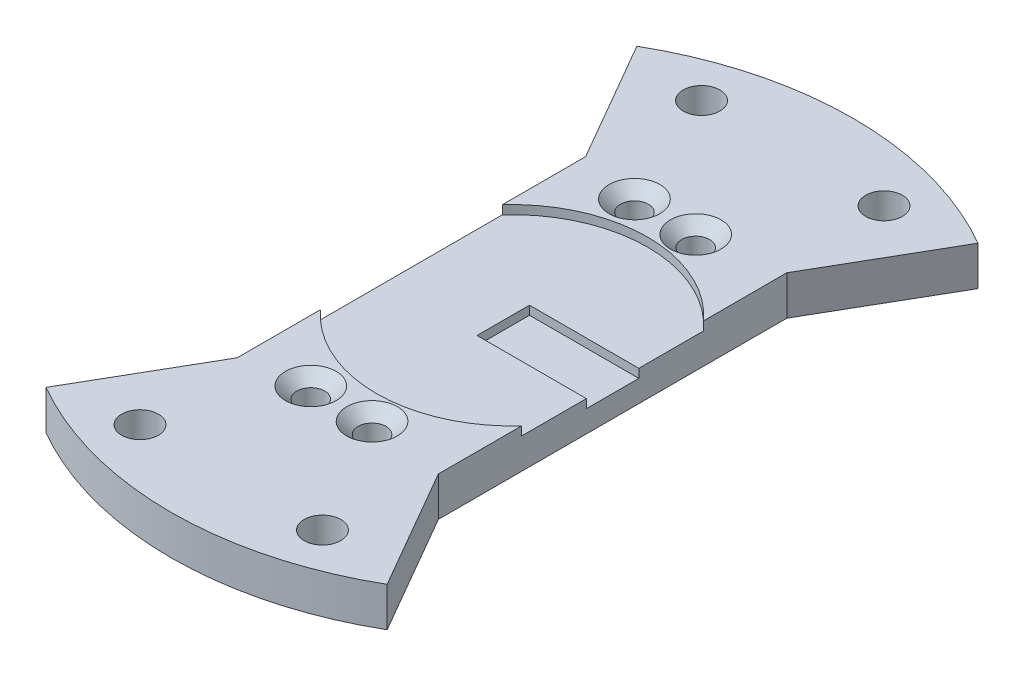
ISO-10303-21;
HEADER;
FILE_DESCRIPTION(('STEP AP214'),'2;1');
FILE_NAME('part.step','',(''),(''),'','','');
FILE_SCHEMA(('AUTOMOTIVE_DESIGN { 1 0 10303 214 1 1 1 1 }'));
ENDSEC;
DATA;
#1=APPLICATION_CONTEXT('core data for automotive mechanical design processes');
#2=APPLICATION_PROTOCOL_DEFINITION('international standard','automotive_design',2000,#1);
#3=PRODUCT_CONTEXT('',#1,'mechanical');
#4=PRODUCT('Part','Part','',(#3));
#5=PRODUCT_RELATED_PRODUCT_CATEGORY('part','',(#4));
#6=PRODUCT_DEFINITION_FORMATION('','',#4);
#7=PRODUCT_DEFINITION_CONTEXT('part definition',#1,'design');
#8=PRODUCT_DEFINITION('design','',#6,#7);
#9=PRODUCT_DEFINITION_SHAPE('','',#8);
#10=(LENGTH_UNIT() NAMED_UNIT(*) SI_UNIT(.MILLI.,.METRE.));
#11=(NAMED_UNIT(*) PLANE_ANGLE_UNIT() SI_UNIT($,.RADIAN.));
#12=(NAMED_UNIT(*) SI_UNIT($,.STERADIAN.) SOLID_ANGLE_UNIT());
#13=UNCERTAINTY_MEASURE_WITH_UNIT(LENGTH_MEASURE(1.E-05),#10,'distance_accuracy_value','');
#14=(GEOMETRIC_REPRESENTATION_CONTEXT(3) GLOBAL_UNCERTAINTY_ASSIGNED_CONTEXT((#13)) GLOBAL_UNIT_ASSIGNED_CONTEXT((#10,
#11,#12)) REPRESENTATION_CONTEXT('',''));
#15=CARTESIAN_POINT('',(0.,0.,0.));
#16=DIRECTION('',(0.,0.,1.));
#17=DIRECTION('',(1.,0.,0.));
#18=AXIS2_PLACEMENT_3D('',#15,#16,#17);
#19=CARTESIAN_POINT('',(0.,4.5,0.));
#20=DIRECTION('',(0.,1.,0.));
#21=DIRECTION('',(0.,0.,1.));
#22=AXIS2_PLACEMENT_3D('',#19,#20,#21);
#23=PLANE('',#22);
#24=CARTESIAN_POINT('',(-4.5,4.5,-18.5));
#25=DIRECTION('',(0.,1.,0.));
#26=DIRECTION('',(0.,0.,1.));
#27=AXIS2_PLACEMENT_3D('',#24,#25,#26);
#28=CIRCLE('',#27,2.9);
#29=CARTESIAN_POINT('',(-4.5,4.5,-15.6));
#30=VERTEX_POINT('',#29);
#31=EDGE_CURVE('E368',#30,#30,#28,.T.);
#32=ORIENTED_EDGE('',*,*,#31,.F.);
#33=EDGE_LOOP('',(#32));
#34=FACE_BOUND('',#33,.T.);
#35=CARTESIAN_POINT('',(2.5,4.5,-18.5));
#36=DIRECTION('',(0.,1.,0.));
#37=DIRECTION('',(0.,0.,1.));
#38=AXIS2_PLACEMENT_3D('',#35,#36,#37);
#39=CIRCLE('',#38,2.9);
#40=CARTESIAN_POINT('',(2.5,4.5,-15.6));
#41=VERTEX_POINT('',#40);
#42=EDGE_CURVE('E379',#41,#41,#39,.T.);
#43=ORIENTED_EDGE('',*,*,#42,.F.);
#44=EDGE_LOOP('',(#43));
#45=FACE_BOUND('',#44,.T.);
#46=CARTESIAN_POINT('',(0.,4.5,0.));
#47=DIRECTION('',(0.,1.,0.));
#48=DIRECTION('',(0.,0.,1.));
#49=AXIS2_PLACEMENT_3D('',#46,#47,#48);
#50=CIRCLE('',#49,15.5);
#51=CARTESIAN_POINT('',(11.5,4.5,-10.3923048454133));
#52=VERTEX_POINT('',#51);
#53=CARTESIAN_POINT('',(-11.5,4.5,-10.3923048454133));
#54=VERTEX_POINT('',#53);
#55=EDGE_CURVE('E274',#52,#54,#50,.T.);
#56=ORIENTED_EDGE('',*,*,#55,.F.);
#57=DIRECTION('',(0.,0.,1.));
#58=VECTOR('',#57,1.);
#59=CARTESIAN_POINT('',(11.5,4.5,0.));
#60=LINE('',#59,#58);
#61=CARTESIAN_POINT('',(11.5,4.5,-19.9185842870421));
#62=VERTEX_POINT('',#61);
#63=EDGE_CURVE('E205',#62,#52,#60,.T.);
#64=ORIENTED_EDGE('',*,*,#63,.F.);
#65=DIRECTION('',(0.5,0.,-0.866025403784439));
#66=VECTOR('',#65,1.);
#67=CARTESIAN_POINT('',(0.,4.5,0.));
#68=LINE('',#67,#66);
#69=CARTESIAN_POINT('',(19.5,4.5,-33.7749907475931));
#70=VERTEX_POINT('',#69);
#71=EDGE_CURVE('E208',#62,#70,#68,.T.);
#72=ORIENTED_EDGE('',*,*,#71,.T.);
#73=CARTESIAN_POINT('',(0.,4.5,0.));
#74=DIRECTION('',(0.,1.,0.));
#75=DIRECTION('',(0.,0.,1.));
#76=AXIS2_PLACEMENT_3D('',#73,#74,#75);
#77=CIRCLE('',#76,39.);
#78=CARTESIAN_POINT('',(-19.5,4.5,-33.7749907475931));
#79=VERTEX_POINT('',#78);
#80=EDGE_CURVE('E210',#70,#79,#77,.T.);
#81=ORIENTED_EDGE('',*,*,#80,.T.);
#82=DIRECTION('',(-0.5,0.,-0.866025403784439));
#83=VECTOR('',#82,1.);
#84=CARTESIAN_POINT('',(0.,4.5,0.));
#85=LINE('',#84,#83);
#86=CARTESIAN_POINT('',(-11.5,4.5,-19.9185842870421));
#87=VERTEX_POINT('',#86);
#88=EDGE_CURVE('E189',#87,#79,#85,.T.);
#89=ORIENTED_EDGE('',*,*,#88,.F.);
#90=DIRECTION('',(0.,0.,1.));
#91=VECTOR('',#90,1.);
#92=CARTESIAN_POINT('',(-11.5,4.5,0.));
#93=LINE('',#92,#91);
#94=EDGE_CURVE('E194',#87,#54,#93,.T.);
#95=ORIENTED_EDGE('',*,*,#94,.T.);
#96=EDGE_LOOP('',(#56,#64,#72,#81,#89,#95));
#97=FACE_BOUND('',#96,.T.);
#98=CARTESIAN_POINT('',(-10.4293235601544,4.5,-32.0981574249615));
#99=DIRECTION('',(0.,1.,0.));
#100=DIRECTION('',(0.,0.,1.));
#101=AXIS2_PLACEMENT_3D('',#98,#99,#100);
#102=CIRCLE('',#101,2.1);
#103=CARTESIAN_POINT('',(-10.4293235601544,4.5,-29.9981574249615));
#104=VERTEX_POINT('',#103);
#105=EDGE_CURVE('E221',#104,#104,#102,.T.);
#106=ORIENTED_EDGE('',*,*,#105,.F.);
#107=EDGE_LOOP('',(#106));
#108=FACE_BOUND('',#107,.T.);
#109=CARTESIAN_POINT('',(10.4293235601546,4.5,-32.0981574249614));
#110=DIRECTION('',(0.,1.,0.));
#111=DIRECTION('',(0.,0.,1.));
#112=AXIS2_PLACEMENT_3D('',#109,#110,#111);
#113=CIRCLE('',#112,2.1);
#114=CARTESIAN_POINT('',(10.4293235601546,4.5,-29.9981574249614));
#115=VERTEX_POINT('',#114);
#116=EDGE_CURVE('E218',#115,#115,#113,.T.);
#117=ORIENTED_EDGE('',*,*,#116,.F.);
#118=EDGE_LOOP('',(#117));
#119=FACE_BOUND('',#118,.T.);
#120=ADVANCED_FACE('F32',(#34,#45,#97,#108,#119),#23,.T.);
#121=CARTESIAN_POINT('',(0.,4.5,0.));
#122=DIRECTION('',(-0.866025403784439,0.,0.5));
#123=DIRECTION('',(0.5,0.,0.866025403784439));
#124=AXIS2_PLACEMENT_3D('',#121,#122,#123);
#125=PLANE('',#124);
#126=DIRECTION('',(-0.5,0.,-0.866025403784439));
#127=VECTOR('',#126,1.);
#128=CARTESIAN_POINT('',(0.,0.,0.));
#129=LINE('',#128,#127);
#130=CARTESIAN_POINT('',(-11.5,0.,-19.9185842870421));
#131=VERTEX_POINT('',#130);
#132=CARTESIAN_POINT('',(-19.5,0.,-33.7749907475931));
#133=VERTEX_POINT('',#132);
#134=EDGE_CURVE('E188',#131,#133,#129,.T.);
#135=ORIENTED_EDGE('',*,*,#134,.F.);
#136=DIRECTION('',(0.,-1.,0.));
#137=VECTOR('',#136,1.);
#138=CARTESIAN_POINT('',(-11.5,4.5,-19.9185842870421));
#139=LINE('',#138,#137);
#140=EDGE_CURVE('E272',#87,#131,#139,.T.);
#141=ORIENTED_EDGE('',*,*,#140,.F.);
#142=ORIENTED_EDGE('',*,*,#88,.T.);
#143=DIRECTION('',(0.,-1.,0.));
#144=VECTOR('',#143,1.);
#145=CARTESIAN_POINT('',(-19.5,4.5,-33.7749907475931));
#146=LINE('',#145,#144);
#147=EDGE_CURVE('E224',#79,#133,#146,.T.);
#148=ORIENTED_EDGE('',*,*,#147,.T.);
#149=EDGE_LOOP('',(#135,#141,#142,#148));
#150=FACE_BOUND('',#149,.T.);
#151=ADVANCED_FACE('F34',(#150),#125,.T.);
#152=CARTESIAN_POINT('',(-11.5,4.5,0.));
#153=DIRECTION('',(1.,0.,0.));
#154=DIRECTION('',(0.,0.,-1.));
#155=AXIS2_PLACEMENT_3D('',#152,#153,#154);
#156=PLANE('',#155);
#157=DIRECTION('',(0.,0.,1.));
#158=VECTOR('',#157,1.);
#159=CARTESIAN_POINT('',(-11.5,3.5,0.));
#160=LINE('',#159,#158);
#161=CARTESIAN_POINT('',(-11.5,3.5,-10.3923048454133));
#162=VERTEX_POINT('',#161);
#163=CARTESIAN_POINT('',(-11.5,3.5,10.3923048454133));
#164=VERTEX_POINT('',#163);
#165=EDGE_CURVE('E186',#162,#164,#160,.T.);
#166=ORIENTED_EDGE('',*,*,#165,.F.);
#167=DIRECTION('',(0.,1.,0.));
#168=VECTOR('',#167,1.);
#169=CARTESIAN_POINT('',(-11.5,3.5,-10.3923048454133));
#170=LINE('',#169,#168);
#171=EDGE_CURVE('E183',#162,#54,#170,.T.);
#172=ORIENTED_EDGE('',*,*,#171,.T.);
#173=ORIENTED_EDGE('',*,*,#94,.F.);
#174=ORIENTED_EDGE('',*,*,#140,.T.);
#175=DIRECTION('',(0.,0.,1.));
#176=VECTOR('',#175,1.);
#177=CARTESIAN_POINT('',(-11.5,0.,0.));
#178=LINE('',#177,#176);
#179=CARTESIAN_POINT('',(-11.5,0.,19.9185842870424));
#180=VERTEX_POINT('',#179);
#181=EDGE_CURVE('E227',#131,#180,#178,.T.);
#182=ORIENTED_EDGE('',*,*,#181,.T.);
#183=DIRECTION('',(0.,-1.,0.));
#184=VECTOR('',#183,1.);
#185=CARTESIAN_POINT('',(-11.5,4.5,19.9185842870424));
#186=LINE('',#185,#184);
#187=CARTESIAN_POINT('',(-11.5,4.5,19.9185842870424));
#188=VERTEX_POINT('',#187);
#189=EDGE_CURVE('E269',#188,#180,#186,.T.);
#190=ORIENTED_EDGE('',*,*,#189,.F.);
#191=CARTESIAN_POINT('',(-11.5,4.5,10.3923048454133));
#192=VERTEX_POINT('',#191);
#193=EDGE_CURVE('E192',#192,#188,#93,.T.);
#194=ORIENTED_EDGE('',*,*,#193,.F.);
#195=DIRECTION('',(0.,1.,0.));
#196=VECTOR('',#195,1.);
#197=CARTESIAN_POINT('',(-11.5,3.5,10.3923048454133));
#198=LINE('',#197,#196);
#199=EDGE_CURVE('E55',#192,#164,#198,.F.);
#200=ORIENTED_EDGE('',*,*,#199,.T.);
#201=EDGE_LOOP('',(#166,#172,#173,#174,#182,#190,#194,#200));
#202=FACE_BOUND('',#201,.T.);
#203=ADVANCED_FACE('F288',(#202),#156,.F.);
#204=CARTESIAN_POINT('',(0.,4.5,0.));
#205=DIRECTION('',(0.866025403784442,0.,0.499999999999995));
#206=DIRECTION('',(0.499999999999995,0.,-0.866025403784442));
#207=AXIS2_PLACEMENT_3D('',#204,#205,#206);
#208=PLANE('',#207);
#209=DIRECTION('',(-0.499999999999995,0.,0.866025403784442));
#210=VECTOR('',#209,1.);
#211=CARTESIAN_POINT('',(0.,0.,0.));
#212=LINE('',#211,#210);
#213=CARTESIAN_POINT('',(-19.4999999999998,0.,33.7749907475932));
#214=VERTEX_POINT('',#213);
#215=EDGE_CURVE('E229',#180,#214,#212,.T.);
#216=ORIENTED_EDGE('',*,*,#215,.T.);
#217=DIRECTION('',(0.,-1.,0.));
#218=VECTOR('',#217,1.);
#219=CARTESIAN_POINT('',(-19.4999999999998,4.5,33.7749907475932));
#220=LINE('',#219,#218);
#221=CARTESIAN_POINT('',(-19.4999999999998,4.5,33.7749907475932));
#222=VERTEX_POINT('',#221);
#223=EDGE_CURVE('E266',#222,#214,#220,.T.);
#224=ORIENTED_EDGE('',*,*,#223,.F.);
#225=DIRECTION('',(-0.499999999999995,0.,0.866025403784442));
#226=VECTOR('',#225,1.);
#227=CARTESIAN_POINT('',(0.,4.5,0.));
#228=LINE('',#227,#226);
#229=EDGE_CURVE('E197',#188,#222,#228,.T.);
#230=ORIENTED_EDGE('',*,*,#229,.F.);
#231=ORIENTED_EDGE('',*,*,#189,.T.);
#232=EDGE_LOOP('',(#216,#224,#230,#231));
#233=FACE_BOUND('',#232,.T.);
#234=ADVANCED_FACE('F618',(#233),#208,.F.);
#235=CARTESIAN_POINT('',(0.,4.5,0.));
#236=DIRECTION('',(0.,-1.,0.));
#237=DIRECTION('',(0.,0.,-1.));
#238=AXIS2_PLACEMENT_3D('',#235,#236,#237);
#239=CYLINDRICAL_SURFACE('',#238,39.);
#240=CARTESIAN_POINT('',(0.,0.,0.));
#241=DIRECTION('',(0.,1.,0.));
#242=DIRECTION('',(0.,0.,1.));
#243=AXIS2_PLACEMENT_3D('',#240,#241,#242);
#244=CIRCLE('',#243,39.);
#245=CARTESIAN_POINT('',(19.4999999999998,0.,33.7749907475932));
#246=VERTEX_POINT('',#245);
#247=EDGE_CURVE('E231',#214,#246,#244,.T.);
#248=ORIENTED_EDGE('',*,*,#247,.T.);
#249=DIRECTION('',(0.,-1.,0.));
#250=VECTOR('',#249,1.);
#251=CARTESIAN_POINT('',(19.4999999999998,4.5,33.7749907475932));
#252=LINE('',#251,#250);
#253=CARTESIAN_POINT('',(19.4999999999998,4.5,33.7749907475932));
#254=VERTEX_POINT('',#253);
#255=EDGE_CURVE('E264',#254,#246,#252,.T.);
#256=ORIENTED_EDGE('',*,*,#255,.F.);
#257=CARTESIAN_POINT('',(0.,4.5,0.));
#258=DIRECTION('',(0.,1.,0.));
#259=DIRECTION('',(0.,0.,1.));
#260=AXIS2_PLACEMENT_3D('',#257,#258,#259);
#261=CIRCLE('',#260,39.);
#262=EDGE_CURVE('E199',#222,#254,#261,.T.);
#263=ORIENTED_EDGE('',*,*,#262,.F.);
#264=ORIENTED_EDGE('',*,*,#223,.T.);
#265=EDGE_LOOP('',(#248,#256,#263,#264));
#266=FACE_BOUND('',#265,.T.);
#267=ADVANCED_FACE('F609',(#266),#239,.T.);
#268=CARTESIAN_POINT('',(0.,4.5,0.));
#269=DIRECTION('',(0.866025403784442,0.,-0.499999999999995));
#270=DIRECTION('',(-0.499999999999995,0.,-0.866025403784442));
#271=AXIS2_PLACEMENT_3D('',#268,#269,#270);
#272=PLANE('',#271);
#273=DIRECTION('',(0.499999999999995,0.,0.866025403784442));
#274=VECTOR('',#273,1.);
#275=CARTESIAN_POINT('',(0.,0.,0.));
#276=LINE('',#275,#274);
#277=CARTESIAN_POINT('',(11.5,0.,19.9185842870424));
#278=VERTEX_POINT('',#277);
#279=EDGE_CURVE('E234',#278,#246,#276,.T.);
#280=ORIENTED_EDGE('',*,*,#279,.F.);
#281=DIRECTION('',(0.,-1.,0.));
#282=VECTOR('',#281,1.);
#283=CARTESIAN_POINT('',(11.5,4.5,19.9185842870424));
#284=LINE('',#283,#282);
#285=CARTESIAN_POINT('',(11.5,4.5,19.9185842870424));
#286=VERTEX_POINT('',#285);
#287=EDGE_CURVE('E262',#286,#278,#284,.T.);
#288=ORIENTED_EDGE('',*,*,#287,.F.);
#289=DIRECTION('',(0.499999999999995,0.,0.866025403784442));
#290=VECTOR('',#289,1.);
#291=CARTESIAN_POINT('',(0.,4.5,0.));
#292=LINE('',#291,#290);
#293=EDGE_CURVE('E201',#286,#254,#292,.T.);
#294=ORIENTED_EDGE('',*,*,#293,.T.);
#295=ORIENTED_EDGE('',*,*,#255,.T.);
#296=EDGE_LOOP('',(#280,#288,#294,#295));
#297=FACE_BOUND('',#296,.T.);
#298=ADVANCED_FACE('F302',(#297),#272,.T.);
#299=CARTESIAN_POINT('',(11.5,4.5,0.));
#300=DIRECTION('',(1.,0.,0.));
#301=DIRECTION('',(0.,0.,-1.));
#302=AXIS2_PLACEMENT_3D('',#299,#300,#301);
#303=PLANE('',#302);
#304=DIRECTION('',(0.,1.,0.));
#305=VECTOR('',#304,1.);
#306=CARTESIAN_POINT('',(11.5,2.5,3.));
#307=LINE('',#306,#305);
#308=CARTESIAN_POINT('',(11.5,2.5,3.));
#309=VERTEX_POINT('',#308);
#310=CARTESIAN_POINT('',(11.5,3.5,3.));
#311=VERTEX_POINT('',#310);
#312=EDGE_CURVE('E176',#309,#311,#307,.T.);
#313=ORIENTED_EDGE('',*,*,#312,.T.);
#314=DIRECTION('',(0.,0.,1.));
#315=VECTOR('',#314,1.);
#316=CARTESIAN_POINT('',(11.5,3.5,0.));
#317=LINE('',#316,#315);
#318=CARTESIAN_POINT('',(11.5,3.5,10.3923048454133));
#319=VERTEX_POINT('',#318);
#320=EDGE_CURVE('E40',#311,#319,#317,.T.);
#321=ORIENTED_EDGE('',*,*,#320,.T.);
#322=DIRECTION('',(0.,1.,0.));
#323=VECTOR('',#322,1.);
#324=CARTESIAN_POINT('',(11.5,3.5,10.3923048454133));
#325=LINE('',#324,#323);
#326=CARTESIAN_POINT('',(11.5,4.5,10.3923048454133));
#327=VERTEX_POINT('',#326);
#328=EDGE_CURVE('E177',#327,#319,#325,.F.);
#329=ORIENTED_EDGE('',*,*,#328,.F.);
#330=EDGE_CURVE('E204',#327,#286,#60,.T.);
#331=ORIENTED_EDGE('',*,*,#330,.T.);
#332=ORIENTED_EDGE('',*,*,#287,.T.);
#333=DIRECTION('',(0.,0.,1.));
#334=VECTOR('',#333,1.);
#335=CARTESIAN_POINT('',(11.5,0.,0.));
#336=LINE('',#335,#334);
#337=CARTESIAN_POINT('',(11.5,0.,-19.9185842870421));
#338=VERTEX_POINT('',#337);
#339=EDGE_CURVE('E237',#338,#278,#336,.T.);
#340=ORIENTED_EDGE('',*,*,#339,.F.);
#341=DIRECTION('',(0.,-1.,0.));
#342=VECTOR('',#341,1.);
#343=CARTESIAN_POINT('',(11.5,4.5,-19.9185842870421));
#344=LINE('',#343,#342);
#345=EDGE_CURVE('E260',#62,#338,#344,.T.);
#346=ORIENTED_EDGE('',*,*,#345,.F.);
#347=ORIENTED_EDGE('',*,*,#63,.T.);
#348=DIRECTION('',(0.,1.,0.));
#349=VECTOR('',#348,1.);
#350=CARTESIAN_POINT('',(11.5,3.5,-10.3923048454133));
#351=LINE('',#350,#349);
#352=CARTESIAN_POINT('',(11.5,3.5,-10.3923048454133));
#353=VERTEX_POINT('',#352);
#354=EDGE_CURVE('E180',#353,#52,#351,.T.);
#355=ORIENTED_EDGE('',*,*,#354,.F.);
#356=CARTESIAN_POINT('',(11.5,3.5,-3.));
#357=VERTEX_POINT('',#356);
#358=EDGE_CURVE('E11',#353,#357,#317,.T.);
#359=ORIENTED_EDGE('',*,*,#358,.T.);
#360=DIRECTION('',(0.,1.,0.));
#361=VECTOR('',#360,1.);
#362=CARTESIAN_POINT('',(11.5,2.5,-3.));
#363=LINE('',#362,#361);
#364=CARTESIAN_POINT('',(11.5,2.5,-3.));
#365=VERTEX_POINT('',#364);
#366=EDGE_CURVE('E47',#365,#357,#363,.T.);
#367=ORIENTED_EDGE('',*,*,#366,.F.);
#368=DIRECTION('',(0.,0.,-1.));
#369=VECTOR('',#368,1.);
#370=CARTESIAN_POINT('',(11.5,2.5,-3.));
#371=LINE('',#370,#369);
#372=EDGE_CURVE('E153',#309,#365,#371,.T.);
#373=ORIENTED_EDGE('',*,*,#372,.F.);
#374=EDGE_LOOP('',(#313,#321,#329,#331,#332,#340,#346,#347,#355,#359,#367,#373));
#375=FACE_BOUND('',#374,.T.);
#376=ADVANCED_FACE('F164',(#375),#303,.T.);
#377=CARTESIAN_POINT('',(0.,4.5,0.));
#378=DIRECTION('',(-0.866025403784439,0.,-0.5));
#379=DIRECTION('',(-0.5,0.,0.866025403784439));
#380=AXIS2_PLACEMENT_3D('',#377,#378,#379);
#381=PLANE('',#380);
#382=DIRECTION('',(0.5,0.,-0.866025403784439));
#383=VECTOR('',#382,1.);
#384=CARTESIAN_POINT('',(0.,0.,0.));
#385=LINE('',#384,#383);
#386=CARTESIAN_POINT('',(19.5,0.,-33.7749907475931));
#387=VERTEX_POINT('',#386);
#388=EDGE_CURVE('E240',#338,#387,#385,.T.);
#389=ORIENTED_EDGE('',*,*,#388,.T.);
#390=DIRECTION('',(0.,-1.,0.));
#391=VECTOR('',#390,1.);
#392=CARTESIAN_POINT('',(19.5,4.5,-33.7749907475931));
#393=LINE('',#392,#391);
#394=EDGE_CURVE('E257',#70,#387,#393,.T.);
#395=ORIENTED_EDGE('',*,*,#394,.F.);
#396=ORIENTED_EDGE('',*,*,#71,.F.);
#397=ORIENTED_EDGE('',*,*,#345,.T.);
#398=EDGE_LOOP('',(#389,#395,#396,#397));
#399=FACE_BOUND('',#398,.T.);
#400=ADVANCED_FACE('F314',(#399),#381,.F.);
#401=CARTESIAN_POINT('',(10.4293235601546,4.5,-32.0981574249614));
#402=DIRECTION('',(0.,-1.,0.));
#403=DIRECTION('',(0.,0.,-1.));
#404=AXIS2_PLACEMENT_3D('',#401,#402,#403);
#405=CYLINDRICAL_SURFACE('',#404,2.1);
#406=ORIENTED_EDGE('',*,*,#116,.T.);
#407=EDGE_LOOP('',(#406));
#408=FACE_BOUND('',#407,.T.);
#409=CARTESIAN_POINT('',(10.4293235601546,0.,-32.0981574249614));
#410=DIRECTION('',(0.,1.,0.));
#411=DIRECTION('',(0.,0.,1.));
#412=AXIS2_PLACEMENT_3D('',#409,#410,#411);
#413=CIRCLE('',#412,2.1);
#414=CARTESIAN_POINT('',(10.4293235601546,0.,-29.9981574249614));
#415=VERTEX_POINT('',#414);
#416=EDGE_CURVE('E251',#415,#415,#413,.T.);
#417=ORIENTED_EDGE('',*,*,#416,.F.);
#418=EDGE_LOOP('',(#417));
#419=FACE_BOUND('',#418,.T.);
#420=ADVANCED_FACE('F590',(#408,#419),#405,.F.);
#421=CARTESIAN_POINT('',(10.4293235601542,4.5,32.0981574249615));
#422=DIRECTION('',(0.,-1.,0.));
#423=DIRECTION('',(0.,0.,-1.));
#424=AXIS2_PLACEMENT_3D('',#421,#422,#423);
#425=CYLINDRICAL_SURFACE('',#424,2.1);
#426=CARTESIAN_POINT('',(10.4293235601542,4.5,32.0981574249615));
#427=DIRECTION('',(0.,1.,0.));
#428=DIRECTION('',(0.,0.,1.));
#429=AXIS2_PLACEMENT_3D('',#426,#427,#428);
#430=CIRCLE('',#429,2.1);
#431=CARTESIAN_POINT('',(10.4293235601542,4.5,34.1981574249615));
#432=VERTEX_POINT('',#431);
#433=EDGE_CURVE('E215',#432,#432,#430,.T.);
#434=ORIENTED_EDGE('',*,*,#433,.T.);
#435=EDGE_LOOP('',(#434));
#436=FACE_BOUND('',#435,.T.);
#437=CARTESIAN_POINT('',(10.4293235601542,0.,32.0981574249615));
#438=DIRECTION('',(0.,1.,0.));
#439=DIRECTION('',(0.,0.,1.));
#440=AXIS2_PLACEMENT_3D('',#437,#438,#439);
#441=CIRCLE('',#440,2.1);
#442=CARTESIAN_POINT('',(10.4293235601542,0.,34.1981574249615));
#443=VERTEX_POINT('',#442);
#444=EDGE_CURVE('E248',#443,#443,#441,.T.);
#445=ORIENTED_EDGE('',*,*,#444,.F.);
#446=EDGE_LOOP('',(#445));
#447=FACE_BOUND('',#446,.T.);
#448=ADVANCED_FACE('F336',(#436,#447),#425,.F.);
#449=CARTESIAN_POINT('',(-10.4293235601548,4.5,32.0981574249613));
#450=DIRECTION('',(0.,-1.,0.));
#451=DIRECTION('',(0.,0.,-1.));
#452=AXIS2_PLACEMENT_3D('',#449,#450,#451);
#453=CYLINDRICAL_SURFACE('',#452,2.1);
#454=CARTESIAN_POINT('',(-10.4293235601548,4.5,32.0981574249613));
#455=DIRECTION('',(0.,1.,0.));
#456=DIRECTION('',(0.,0.,1.));
#457=AXIS2_PLACEMENT_3D('',#454,#455,#456);
#458=CIRCLE('',#457,2.1);
#459=CARTESIAN_POINT('',(-10.4293235601548,4.5,34.1981574249613));
#460=VERTEX_POINT('',#459);
#461=EDGE_CURVE('E212',#460,#460,#458,.T.);
#462=ORIENTED_EDGE('',*,*,#461,.T.);
#463=EDGE_LOOP('',(#462));
#464=FACE_BOUND('',#463,.T.);
#465=CARTESIAN_POINT('',(-10.4293235601548,0.,32.0981574249613));
#466=DIRECTION('',(0.,1.,0.));
#467=DIRECTION('',(0.,0.,1.));
#468=AXIS2_PLACEMENT_3D('',#465,#466,#467);
#469=CIRCLE('',#468,2.1);
#470=CARTESIAN_POINT('',(-10.4293235601548,0.,34.1981574249613));
#471=VERTEX_POINT('',#470);
#472=EDGE_CURVE('E245',#471,#471,#469,.T.);
#473=ORIENTED_EDGE('',*,*,#472,.F.);
#474=EDGE_LOOP('',(#473));
#475=FACE_BOUND('',#474,.T.);
#476=ADVANCED_FACE('F328',(#464,#475),#453,.F.);
#477=CARTESIAN_POINT('',(0.,4.5,0.));
#478=DIRECTION('',(0.,-1.,0.));
#479=DIRECTION('',(0.,0.,-1.));
#480=AXIS2_PLACEMENT_3D('',#477,#478,#479);
#481=CYLINDRICAL_SURFACE('',#480,39.);
#482=CARTESIAN_POINT('',(0.,0.,0.));
#483=DIRECTION('',(0.,1.,0.));
#484=DIRECTION('',(0.,0.,1.));
#485=AXIS2_PLACEMENT_3D('',#482,#483,#484);
#486=CIRCLE('',#485,39.);
#487=EDGE_CURVE('E242',#387,#133,#486,.T.);
#488=ORIENTED_EDGE('',*,*,#487,.T.);
#489=ORIENTED_EDGE('',*,*,#147,.F.);
#490=ORIENTED_EDGE('',*,*,#80,.F.);
#491=ORIENTED_EDGE('',*,*,#394,.T.);
#492=EDGE_LOOP('',(#488,#489,#490,#491));
#493=FACE_BOUND('',#492,.T.);
#494=ADVANCED_FACE('F325',(#493),#481,.T.);
#495=CARTESIAN_POINT('',(-10.4293235601544,4.5,-32.0981574249615));
#496=DIRECTION('',(0.,-1.,0.));
#497=DIRECTION('',(0.,0.,-1.));
#498=AXIS2_PLACEMENT_3D('',#495,#496,#497);
#499=CYLINDRICAL_SURFACE('',#498,2.1);
#500=ORIENTED_EDGE('',*,*,#105,.T.);
#501=EDGE_LOOP('',(#500));
#502=FACE_BOUND('',#501,.T.);
#503=CARTESIAN_POINT('',(-10.4293235601544,0.,-32.0981574249615));
#504=DIRECTION('',(0.,1.,0.));
#505=DIRECTION('',(0.,0.,1.));
#506=AXIS2_PLACEMENT_3D('',#503,#504,#505);
#507=CIRCLE('',#506,2.1);
#508=CARTESIAN_POINT('',(-10.4293235601544,0.,-29.9981574249615));
#509=VERTEX_POINT('',#508);
#510=EDGE_CURVE('E193',#509,#509,#507,.T.);
#511=ORIENTED_EDGE('',*,*,#510,.F.);
#512=EDGE_LOOP('',(#511));
#513=FACE_BOUND('',#512,.T.);
#514=ADVANCED_FACE('F327',(#502,#513),#499,.F.);
#515=CARTESIAN_POINT('',(-4.5,4.5,18.5));
#516=DIRECTION('',(0.,1.,0.));
#517=DIRECTION('',(0.,0.,1.));
#518=AXIS2_PLACEMENT_3D('',#515,#516,#517);
#519=CIRCLE('',#518,2.9);
#520=CARTESIAN_POINT('',(-4.5,4.5,21.4));
#521=VERTEX_POINT('',#520);
#522=EDGE_CURVE('E359',#521,#521,#519,.T.);
#523=ORIENTED_EDGE('',*,*,#522,.F.);
#524=EDGE_LOOP('',(#523));
#525=FACE_BOUND('',#524,.T.);
#526=CARTESIAN_POINT('',(2.5,4.5,18.5));
#527=DIRECTION('',(0.,1.,0.));
#528=DIRECTION('',(0.,0.,1.));
#529=AXIS2_PLACEMENT_3D('',#526,#527,#528);
#530=CIRCLE('',#529,2.9);
#531=CARTESIAN_POINT('',(2.5,4.5,21.4));
#532=VERTEX_POINT('',#531);
#533=EDGE_CURVE('E362',#532,#532,#530,.T.);
#534=ORIENTED_EDGE('',*,*,#533,.F.);
#535=EDGE_LOOP('',(#534));
#536=FACE_BOUND('',#535,.T.);
#537=EDGE_CURVE('E273',#192,#327,#50,.T.);
#538=ORIENTED_EDGE('',*,*,#537,.F.);
#539=ORIENTED_EDGE('',*,*,#193,.T.);
#540=ORIENTED_EDGE('',*,*,#229,.T.);
#541=ORIENTED_EDGE('',*,*,#262,.T.);
#542=ORIENTED_EDGE('',*,*,#293,.F.);
#543=ORIENTED_EDGE('',*,*,#330,.F.);
#544=EDGE_LOOP('',(#538,#539,#540,#541,#542,#543));
#545=FACE_BOUND('',#544,.T.);
#546=ORIENTED_EDGE('',*,*,#461,.F.);
#547=EDGE_LOOP('',(#546));
#548=FACE_BOUND('',#547,.T.);
#549=ORIENTED_EDGE('',*,*,#433,.F.);
#550=EDGE_LOOP('',(#549));
#551=FACE_BOUND('',#550,.T.);
#552=ADVANCED_FACE('F294',(#525,#536,#545,#548,#551),#23,.T.);
#553=CARTESIAN_POINT('',(0.,0.,0.));
#554=DIRECTION('',(0.,1.,0.));
#555=DIRECTION('',(0.,0.,1.));
#556=AXIS2_PLACEMENT_3D('',#553,#554,#555);
#557=PLANE('',#556);
#558=CARTESIAN_POINT('',(2.5,0.,18.5));
#559=DIRECTION('',(0.,1.,0.));
#560=DIRECTION('',(0.,0.,1.));
#561=AXIS2_PLACEMENT_3D('',#558,#559,#560);
#562=CIRCLE('',#561,1.6);
#563=CARTESIAN_POINT('',(2.5,0.,20.1));
#564=VERTEX_POINT('',#563);
#565=EDGE_CURVE('E389',#564,#564,#562,.T.);
#566=ORIENTED_EDGE('',*,*,#565,.T.);
#567=EDGE_LOOP('',(#566));
#568=FACE_BOUND('',#567,.T.);
#569=CARTESIAN_POINT('',(-4.5,0.,-18.5));
#570=DIRECTION('',(0.,1.,0.));
#571=DIRECTION('',(0.,0.,1.));
#572=AXIS2_PLACEMENT_3D('',#569,#570,#571);
#573=CIRCLE('',#572,1.6);
#574=CARTESIAN_POINT('',(-4.5,0.,-16.9));
#575=VERTEX_POINT('',#574);
#576=EDGE_CURVE('E388',#575,#575,#573,.T.);
#577=ORIENTED_EDGE('',*,*,#576,.T.);
#578=EDGE_LOOP('',(#577));
#579=FACE_BOUND('',#578,.T.);
#580=CARTESIAN_POINT('',(2.5,0.,-18.5));
#581=DIRECTION('',(0.,1.,0.));
#582=DIRECTION('',(0.,0.,1.));
#583=AXIS2_PLACEMENT_3D('',#580,#581,#582);
#584=CIRCLE('',#583,1.6);
#585=CARTESIAN_POINT('',(2.5,0.,-16.9));
#586=VERTEX_POINT('',#585);
#587=EDGE_CURVE('E385',#586,#586,#584,.T.);
#588=ORIENTED_EDGE('',*,*,#587,.T.);
#589=EDGE_LOOP('',(#588));
#590=FACE_BOUND('',#589,.T.);
#591=CARTESIAN_POINT('',(-4.5,0.,18.5));
#592=DIRECTION('',(0.,1.,0.));
#593=DIRECTION('',(0.,0.,1.));
#594=AXIS2_PLACEMENT_3D('',#591,#592,#593);
#595=CIRCLE('',#594,1.6);
#596=CARTESIAN_POINT('',(-4.5,0.,20.1));
#597=VERTEX_POINT('',#596);
#598=EDGE_CURVE('E392',#597,#597,#595,.T.);
#599=ORIENTED_EDGE('',*,*,#598,.T.);
#600=EDGE_LOOP('',(#599));
#601=FACE_BOUND('',#600,.T.);
#602=ORIENTED_EDGE('',*,*,#134,.T.);
#603=ORIENTED_EDGE('',*,*,#487,.F.);
#604=ORIENTED_EDGE('',*,*,#388,.F.);
#605=ORIENTED_EDGE('',*,*,#339,.T.);
#606=ORIENTED_EDGE('',*,*,#279,.T.);
#607=ORIENTED_EDGE('',*,*,#247,.F.);
#608=ORIENTED_EDGE('',*,*,#215,.F.);
#609=ORIENTED_EDGE('',*,*,#181,.F.);
#610=EDGE_LOOP('',(#602,#603,#604,#605,#606,#607,#608,#609));
#611=FACE_BOUND('',#610,.T.);
#612=ORIENTED_EDGE('',*,*,#472,.T.);
#613=EDGE_LOOP('',(#612));
#614=FACE_BOUND('',#613,.T.);
#615=ORIENTED_EDGE('',*,*,#444,.T.);
#616=EDGE_LOOP('',(#615));
#617=FACE_BOUND('',#616,.T.);
#618=ORIENTED_EDGE('',*,*,#416,.T.);
#619=EDGE_LOOP('',(#618));
#620=FACE_BOUND('',#619,.T.);
#621=ORIENTED_EDGE('',*,*,#510,.T.);
#622=EDGE_LOOP('',(#621));
#623=FACE_BOUND('',#622,.T.);
#624=ADVANCED_FACE('F307',(#568,#579,#590,#601,#611,#614,#617,#620,#623),#557,.F.);
#625=CARTESIAN_POINT('',(0.,3.5,0.));
#626=DIRECTION('',(0.,1.,0.));
#627=DIRECTION('',(0.,0.,1.));
#628=AXIS2_PLACEMENT_3D('',#625,#626,#627);
#629=PLANE('',#628);
#630=DIRECTION('',(1.,0.,0.));
#631=VECTOR('',#630,1.);
#632=CARTESIAN_POINT('',(11.5,3.5,3.));
#633=LINE('',#632,#631);
#634=CARTESIAN_POINT('',(-0.999999999999999,3.5,3.));
#635=VERTEX_POINT('',#634);
#636=EDGE_CURVE('E162',#635,#311,#633,.T.);
#637=ORIENTED_EDGE('',*,*,#636,.F.);
#638=DIRECTION('',(0.,0.,1.));
#639=VECTOR('',#638,1.);
#640=CARTESIAN_POINT('',(-0.999999999999999,3.5,-3.));
#641=LINE('',#640,#639);
#642=CARTESIAN_POINT('',(-0.999999999999999,3.5,-3.));
#643=VERTEX_POINT('',#642);
#644=EDGE_CURVE('E400',#643,#635,#641,.T.);
#645=ORIENTED_EDGE('',*,*,#644,.F.);
#646=DIRECTION('',(-1.,0.,0.));
#647=VECTOR('',#646,1.);
#648=CARTESIAN_POINT('',(11.5,3.5,-3.));
#649=LINE('',#648,#647);
#650=EDGE_CURVE('E396',#357,#643,#649,.T.);
#651=ORIENTED_EDGE('',*,*,#650,.F.);
#652=ORIENTED_EDGE('',*,*,#358,.F.);
#653=CARTESIAN_POINT('',(0.,3.5,0.));
#654=DIRECTION('',(0.,1.,0.));
#655=DIRECTION('',(0.,0.,1.));
#656=AXIS2_PLACEMENT_3D('',#653,#654,#655);
#657=CIRCLE('',#656,15.5);
#658=EDGE_CURVE('E175',#353,#162,#657,.T.);
#659=ORIENTED_EDGE('',*,*,#658,.T.);
#660=ORIENTED_EDGE('',*,*,#165,.T.);
#661=EDGE_CURVE('E172',#164,#319,#657,.T.);
#662=ORIENTED_EDGE('',*,*,#661,.T.);
#663=ORIENTED_EDGE('',*,*,#320,.F.);
#664=EDGE_LOOP('',(#637,#645,#651,#652,#659,#660,#662,#663));
#665=FACE_BOUND('',#664,.T.);
#666=ADVANCED_FACE('F283',(#665),#629,.T.);
#667=CARTESIAN_POINT('',(0.,3.5,0.));
#668=DIRECTION('',(0.,1.,0.));
#669=DIRECTION('',(0.,0.,1.));
#670=AXIS2_PLACEMENT_3D('',#667,#668,#669);
#671=CYLINDRICAL_SURFACE('',#670,15.5);
#672=ORIENTED_EDGE('',*,*,#658,.F.);
#673=ORIENTED_EDGE('',*,*,#354,.T.);
#674=ORIENTED_EDGE('',*,*,#55,.T.);
#675=ORIENTED_EDGE('',*,*,#171,.F.);
#676=EDGE_LOOP('',(#672,#673,#674,#675));
#677=FACE_BOUND('',#676,.T.);
#678=ADVANCED_FACE('F409',(#677),#671,.F.);
#679=ORIENTED_EDGE('',*,*,#537,.T.);
#680=ORIENTED_EDGE('',*,*,#328,.T.);
#681=ORIENTED_EDGE('',*,*,#661,.F.);
#682=ORIENTED_EDGE('',*,*,#199,.F.);
#683=EDGE_LOOP('',(#679,#680,#681,#682));
#684=FACE_BOUND('',#683,.T.);
#685=ADVANCED_FACE('F282',(#684),#671,.F.);
#686=CARTESIAN_POINT('',(11.5,2.5,3.));
#687=DIRECTION('',(0.,0.,1.));
#688=DIRECTION('',(1.,0.,0.));
#689=AXIS2_PLACEMENT_3D('',#686,#687,#688);
#690=PLANE('',#689);
#691=ORIENTED_EDGE('',*,*,#636,.T.);
#692=ORIENTED_EDGE('',*,*,#312,.F.);
#693=DIRECTION('',(1.,0.,0.));
#694=VECTOR('',#693,1.);
#695=CARTESIAN_POINT('',(11.5,2.5,3.));
#696=LINE('',#695,#694);
#697=CARTESIAN_POINT('',(-0.999999999999999,2.5,3.));
#698=VERTEX_POINT('',#697);
#699=EDGE_CURVE('E159',#698,#309,#696,.T.);
#700=ORIENTED_EDGE('',*,*,#699,.F.);
#701=DIRECTION('',(0.,1.,0.));
#702=VECTOR('',#701,1.);
#703=CARTESIAN_POINT('',(-0.999999999999999,2.5,3.));
#704=LINE('',#703,#702);
#705=EDGE_CURVE('E167',#698,#635,#704,.T.);
#706=ORIENTED_EDGE('',*,*,#705,.T.);
#707=EDGE_LOOP('',(#691,#692,#700,#706));
#708=FACE_BOUND('',#707,.T.);
#709=ADVANCED_FACE('F405',(#708),#690,.F.);
#710=CARTESIAN_POINT('',(-0.999999999999999,2.5,-3.));
#711=DIRECTION('',(-1.,0.,0.));
#712=DIRECTION('',(0.,0.,1.));
#713=AXIS2_PLACEMENT_3D('',#710,#711,#712);
#714=PLANE('',#713);
#715=ORIENTED_EDGE('',*,*,#644,.T.);
#716=ORIENTED_EDGE('',*,*,#705,.F.);
#717=DIRECTION('',(0.,0.,1.));
#718=VECTOR('',#717,1.);
#719=CARTESIAN_POINT('',(-0.999999999999999,2.5,-3.));
#720=LINE('',#719,#718);
#721=CARTESIAN_POINT('',(-0.999999999999999,2.5,-3.));
#722=VERTEX_POINT('',#721);
#723=EDGE_CURVE('E152',#722,#698,#720,.T.);
#724=ORIENTED_EDGE('',*,*,#723,.F.);
#725=DIRECTION('',(0.,1.,0.));
#726=VECTOR('',#725,1.);
#727=CARTESIAN_POINT('',(-0.999999999999999,2.5,-3.));
#728=LINE('',#727,#726);
#729=EDGE_CURVE('E148',#722,#643,#728,.T.);
#730=ORIENTED_EDGE('',*,*,#729,.T.);
#731=EDGE_LOOP('',(#715,#716,#724,#730));
#732=FACE_BOUND('',#731,.T.);
#733=ADVANCED_FACE('F408',(#732),#714,.F.);
#734=CARTESIAN_POINT('',(11.5,2.5,-3.));
#735=DIRECTION('',(0.,0.,-1.));
#736=DIRECTION('',(-1.,0.,0.));
#737=AXIS2_PLACEMENT_3D('',#734,#735,#736);
#738=PLANE('',#737);
#739=ORIENTED_EDGE('',*,*,#650,.T.);
#740=ORIENTED_EDGE('',*,*,#729,.F.);
#741=DIRECTION('',(-1.,0.,0.));
#742=VECTOR('',#741,1.);
#743=CARTESIAN_POINT('',(11.5,2.5,-3.));
#744=LINE('',#743,#742);
#745=EDGE_CURVE('E145',#365,#722,#744,.T.);
#746=ORIENTED_EDGE('',*,*,#745,.F.);
#747=ORIENTED_EDGE('',*,*,#366,.T.);
#748=EDGE_LOOP('',(#739,#740,#746,#747));
#749=FACE_BOUND('',#748,.T.);
#750=ADVANCED_FACE('F147',(#749),#738,.F.);
#751=CARTESIAN_POINT('',(0.,2.5,0.));
#752=DIRECTION('',(0.,-1.,0.));
#753=DIRECTION('',(0.,0.,-1.));
#754=AXIS2_PLACEMENT_3D('',#751,#752,#753);
#755=PLANE('',#754);
#756=ORIENTED_EDGE('',*,*,#372,.T.);
#757=ORIENTED_EDGE('',*,*,#745,.T.);
#758=ORIENTED_EDGE('',*,*,#723,.T.);
#759=ORIENTED_EDGE('',*,*,#699,.T.);
#760=EDGE_LOOP('',(#756,#757,#758,#759));
#761=FACE_BOUND('',#760,.T.);
#762=ADVANCED_FACE('F157',(#761),#755,.F.);
#763=CARTESIAN_POINT('',(-4.5,0.,18.5));
#764=DIRECTION('',(0.,1.,0.));
#765=DIRECTION('',(0.,0.,1.));
#766=AXIS2_PLACEMENT_3D('',#763,#764,#765);
#767=CYLINDRICAL_SURFACE('',#766,1.6);
#768=CARTESIAN_POINT('',(-4.5,3.2,18.5));
#769=DIRECTION('',(0.,1.,0.));
#770=DIRECTION('',(0.,0.,1.));
#771=AXIS2_PLACEMENT_3D('',#768,#769,#770);
#772=CIRCLE('',#771,1.6);
#773=CARTESIAN_POINT('',(-4.5,3.2,20.1));
#774=VERTEX_POINT('',#773);
#775=EDGE_CURVE('E365',#774,#774,#772,.T.);
#776=ORIENTED_EDGE('',*,*,#775,.T.);
#777=EDGE_LOOP('',(#776));
#778=FACE_BOUND('',#777,.T.);
#779=ORIENTED_EDGE('',*,*,#598,.F.);
#780=EDGE_LOOP('',(#779));
#781=FACE_BOUND('',#780,.T.);
#782=ADVANCED_FACE('F425',(#778,#781),#767,.F.);
#783=CARTESIAN_POINT('',(2.5,0.,-18.5));
#784=DIRECTION('',(0.,1.,0.));
#785=DIRECTION('',(0.,0.,1.));
#786=AXIS2_PLACEMENT_3D('',#783,#784,#785);
#787=CYLINDRICAL_SURFACE('',#786,1.6);
#788=CARTESIAN_POINT('',(2.5,3.2,-18.5));
#789=DIRECTION('',(0.,1.,0.));
#790=DIRECTION('',(0.,0.,1.));
#791=AXIS2_PLACEMENT_3D('',#788,#789,#790);
#792=CIRCLE('',#791,1.6);
#793=CARTESIAN_POINT('',(2.5,3.2,-16.9));
#794=VERTEX_POINT('',#793);
#795=EDGE_CURVE('E382',#794,#794,#792,.T.);
#796=ORIENTED_EDGE('',*,*,#795,.T.);
#797=EDGE_LOOP('',(#796));
#798=FACE_BOUND('',#797,.T.);
#799=ORIENTED_EDGE('',*,*,#587,.F.);
#800=EDGE_LOOP('',(#799));
#801=FACE_BOUND('',#800,.T.);
#802=ADVANCED_FACE('F428',(#798,#801),#787,.F.);
#803=CARTESIAN_POINT('',(-4.5,0.,-18.5));
#804=DIRECTION('',(0.,1.,0.));
#805=DIRECTION('',(0.,0.,1.));
#806=AXIS2_PLACEMENT_3D('',#803,#804,#805);
#807=CYLINDRICAL_SURFACE('',#806,1.6);
#808=CARTESIAN_POINT('',(-4.5,3.2,-18.5));
#809=DIRECTION('',(0.,1.,0.));
#810=DIRECTION('',(0.,0.,1.));
#811=AXIS2_PLACEMENT_3D('',#808,#809,#810);
#812=CIRCLE('',#811,1.6);
#813=CARTESIAN_POINT('',(-4.5,3.2,-16.9));
#814=VERTEX_POINT('',#813);
#815=EDGE_CURVE('E376',#814,#814,#812,.T.);
#816=ORIENTED_EDGE('',*,*,#815,.T.);
#817=EDGE_LOOP('',(#816));
#818=FACE_BOUND('',#817,.T.);
#819=ORIENTED_EDGE('',*,*,#576,.F.);
#820=EDGE_LOOP('',(#819));
#821=FACE_BOUND('',#820,.T.);
#822=ADVANCED_FACE('F430',(#818,#821),#807,.F.);
#823=CARTESIAN_POINT('',(2.5,0.,18.5));
#824=DIRECTION('',(0.,1.,0.));
#825=DIRECTION('',(0.,0.,1.));
#826=AXIS2_PLACEMENT_3D('',#823,#824,#825);
#827=CYLINDRICAL_SURFACE('',#826,1.6);
#828=CARTESIAN_POINT('',(2.5,3.2,18.5));
#829=DIRECTION('',(0.,1.,0.));
#830=DIRECTION('',(0.,0.,1.));
#831=AXIS2_PLACEMENT_3D('',#828,#829,#830);
#832=CIRCLE('',#831,1.6);
#833=CARTESIAN_POINT('',(2.5,3.2,20.1));
#834=VERTEX_POINT('',#833);
#835=EDGE_CURVE('E364',#834,#834,#832,.T.);
#836=ORIENTED_EDGE('',*,*,#835,.T.);
#837=EDGE_LOOP('',(#836));
#838=FACE_BOUND('',#837,.T.);
#839=ORIENTED_EDGE('',*,*,#565,.F.);
#840=EDGE_LOOP('',(#839));
#841=FACE_BOUND('',#840,.T.);
#842=ADVANCED_FACE('F433',(#838,#841),#827,.F.);
#843=CARTESIAN_POINT('',(2.5,4.5,-18.5));
#844=DIRECTION('',(0.,1.,0.));
#845=DIRECTION('',(0.,0.,1.));
#846=AXIS2_PLACEMENT_3D('',#843,#844,#845);
#847=CONICAL_SURFACE('',#846,2.9,0.785398163397449);
#848=ORIENTED_EDGE('',*,*,#795,.F.);
#849=EDGE_LOOP('',(#848));
#850=FACE_BOUND('',#849,.T.);
#851=ORIENTED_EDGE('',*,*,#42,.T.);
#852=EDGE_LOOP('',(#851));
#853=FACE_BOUND('',#852,.T.);
#854=ADVANCED_FACE('F437',(#850,#853),#847,.F.);
#855=CARTESIAN_POINT('',(-4.5,4.5,-18.5));
#856=DIRECTION('',(0.,1.,0.));
#857=DIRECTION('',(0.,0.,1.));
#858=AXIS2_PLACEMENT_3D('',#855,#856,#857);
#859=CONICAL_SURFACE('',#858,2.9,0.785398163397449);
#860=ORIENTED_EDGE('',*,*,#815,.F.);
#861=EDGE_LOOP('',(#860));
#862=FACE_BOUND('',#861,.T.);
#863=ORIENTED_EDGE('',*,*,#31,.T.);
#864=EDGE_LOOP('',(#863));
#865=FACE_BOUND('',#864,.T.);
#866=ADVANCED_FACE('F444',(#862,#865),#859,.F.);
#867=CARTESIAN_POINT('',(2.5,4.5,18.5));
#868=DIRECTION('',(0.,1.,0.));
#869=DIRECTION('',(0.,0.,1.));
#870=AXIS2_PLACEMENT_3D('',#867,#868,#869);
#871=CONICAL_SURFACE('',#870,2.9,0.785398163397449);
#872=ORIENTED_EDGE('',*,*,#835,.F.);
#873=EDGE_LOOP('',(#872));
#874=FACE_BOUND('',#873,.T.);
#875=ORIENTED_EDGE('',*,*,#533,.T.);
#876=EDGE_LOOP('',(#875));
#877=FACE_BOUND('',#876,.T.);
#878=ADVANCED_FACE('F448',(#874,#877),#871,.F.);
#879=CARTESIAN_POINT('',(-4.5,4.5,18.5));
#880=DIRECTION('',(0.,1.,0.));
#881=DIRECTION('',(0.,0.,1.));
#882=AXIS2_PLACEMENT_3D('',#879,#880,#881);
#883=CONICAL_SURFACE('',#882,2.9,0.785398163397449);
#884=ORIENTED_EDGE('',*,*,#775,.F.);
#885=EDGE_LOOP('',(#884));
#886=FACE_BOUND('',#885,.T.);
#887=ORIENTED_EDGE('',*,*,#522,.T.);
#888=EDGE_LOOP('',(#887));
#889=FACE_BOUND('',#888,.T.);
#890=ADVANCED_FACE('F452',(#886,#889),#883,.F.);
#891=CLOSED_SHELL('',(#120,#151,#203,#234,#267,#298,#376,#400,#420,#448,#476,#494,#514,#552,
#624,#666,#678,#685,#709,#733,#750,#762,#782,#802,#822,#842,#854,#866,#878,#890));
#892=MANIFOLD_SOLID_BREP('B2',#891);
#893=ADVANCED_BREP_SHAPE_REPRESENTATION('',(#18,#892),#14);
#894=SHAPE_DEFINITION_REPRESENTATION(#9,#893);
ENDSEC;
END-ISO-10303-21;
